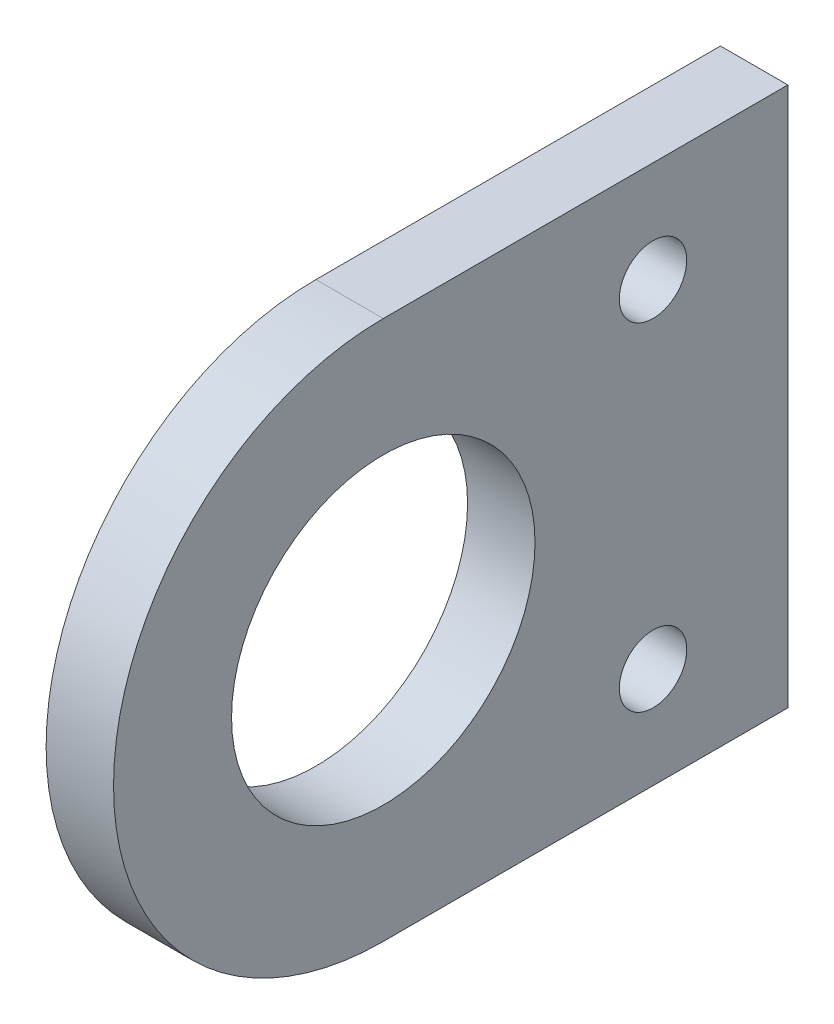
ISO-10303-21;
HEADER;
FILE_DESCRIPTION(('STEP AP214'),'2;1');
FILE_NAME('part.step','',(''),(''),'','','');
FILE_SCHEMA(('AUTOMOTIVE_DESIGN { 1 0 10303 214 1 1 1 1 }'));
ENDSEC;
DATA;
#1=APPLICATION_CONTEXT('core data for automotive mechanical design processes');
#2=APPLICATION_PROTOCOL_DEFINITION('international standard','automotive_design',2000,#1);
#3=PRODUCT_CONTEXT('',#1,'mechanical');
#4=PRODUCT('Part','Part','',(#3));
#5=PRODUCT_RELATED_PRODUCT_CATEGORY('part','',(#4));
#6=PRODUCT_DEFINITION_FORMATION('','',#4);
#7=PRODUCT_DEFINITION_CONTEXT('part definition',#1,'design');
#8=PRODUCT_DEFINITION('design','',#6,#7);
#9=PRODUCT_DEFINITION_SHAPE('','',#8);
#10=(LENGTH_UNIT() NAMED_UNIT(*) SI_UNIT(.MILLI.,.METRE.));
#11=(NAMED_UNIT(*) PLANE_ANGLE_UNIT() SI_UNIT($,.RADIAN.));
#12=(NAMED_UNIT(*) SI_UNIT($,.STERADIAN.) SOLID_ANGLE_UNIT());
#13=UNCERTAINTY_MEASURE_WITH_UNIT(LENGTH_MEASURE(1.E-05),#10,'distance_accuracy_value','');
#14=(GEOMETRIC_REPRESENTATION_CONTEXT(3) GLOBAL_UNCERTAINTY_ASSIGNED_CONTEXT((#13)) GLOBAL_UNIT_ASSIGNED_CONTEXT((#10,
#11,#12)) REPRESENTATION_CONTEXT('',''));
#15=CARTESIAN_POINT('',(0.,0.,0.));
#16=DIRECTION('',(0.,0.,1.));
#17=DIRECTION('',(1.,0.,0.));
#18=AXIS2_PLACEMENT_3D('',#15,#16,#17);
#19=CARTESIAN_POINT('',(6.35,0.,0.));
#20=DIRECTION('',(-1.,0.,0.));
#21=DIRECTION('',(0.,0.,1.));
#22=AXIS2_PLACEMENT_3D('',#19,#20,#21);
#23=PLANE('',#22);
#24=CARTESIAN_POINT('',(6.35,0.,0.));
#25=DIRECTION('',(1.,0.,0.));
#26=DIRECTION('',(0.,0.,1.));
#27=AXIS2_PLACEMENT_3D('',#24,#25,#26);
#28=CIRCLE('',#27,25.4);
#29=CARTESIAN_POINT('',(6.35,25.4,0.));
#30=VERTEX_POINT('',#29);
#31=CARTESIAN_POINT('',(6.35,-25.4,0.));
#32=VERTEX_POINT('',#31);
#33=EDGE_CURVE('E84',#30,#32,#28,.T.);
#34=ORIENTED_EDGE('',*,*,#33,.T.);
#35=DIRECTION('',(0.,0.,-1.));
#36=VECTOR('',#35,1.);
#37=CARTESIAN_POINT('',(6.35,-25.4,-38.1));
#38=LINE('',#37,#36);
#39=CARTESIAN_POINT('',(6.35,-25.4,-38.1));
#40=VERTEX_POINT('',#39);
#41=EDGE_CURVE('E79',#32,#40,#38,.T.);
#42=ORIENTED_EDGE('',*,*,#41,.T.);
#43=DIRECTION('',(0.,1.,0.));
#44=VECTOR('',#43,1.);
#45=CARTESIAN_POINT('',(6.35,25.4,-38.1));
#46=LINE('',#45,#44);
#47=CARTESIAN_POINT('',(6.35,25.4,-38.1));
#48=VERTEX_POINT('',#47);
#49=EDGE_CURVE('E82',#40,#48,#46,.T.);
#50=ORIENTED_EDGE('',*,*,#49,.T.);
#51=DIRECTION('',(0.,0.,1.));
#52=VECTOR('',#51,1.);
#53=CARTESIAN_POINT('',(6.35,25.4,0.));
#54=LINE('',#53,#52);
#55=EDGE_CURVE('E49',#48,#30,#54,.T.);
#56=ORIENTED_EDGE('',*,*,#55,.T.);
#57=EDGE_LOOP('',(#34,#42,#50,#56));
#58=FACE_BOUND('',#57,.T.);
#59=CARTESIAN_POINT('',(6.35,0.,0.));
#60=DIRECTION('',(1.,0.,0.));
#61=DIRECTION('',(0.,0.,-1.));
#62=AXIS2_PLACEMENT_3D('',#59,#60,#61);
#63=CIRCLE('',#62,14.2875);
#64=CARTESIAN_POINT('',(6.35,0.,-14.2875));
#65=VERTEX_POINT('',#64);
#66=EDGE_CURVE('E99',#65,#65,#63,.T.);
#67=ORIENTED_EDGE('',*,*,#66,.F.);
#68=EDGE_LOOP('',(#67));
#69=FACE_BOUND('',#68,.T.);
#70=CARTESIAN_POINT('',(6.35,15.875,-25.4));
#71=DIRECTION('',(1.,0.,0.));
#72=DIRECTION('',(0.,0.,-1.));
#73=AXIS2_PLACEMENT_3D('',#70,#71,#72);
#74=CIRCLE('',#73,3.175);
#75=CARTESIAN_POINT('',(6.35,15.875,-28.575));
#76=VERTEX_POINT('',#75);
#77=EDGE_CURVE('E114',#76,#76,#74,.T.);
#78=ORIENTED_EDGE('',*,*,#77,.F.);
#79=EDGE_LOOP('',(#78));
#80=FACE_BOUND('',#79,.T.);
#81=CARTESIAN_POINT('',(6.35,-15.875,-25.4));
#82=DIRECTION('',(1.,0.,0.));
#83=DIRECTION('',(0.,0.,-1.));
#84=AXIS2_PLACEMENT_3D('',#81,#82,#83);
#85=CIRCLE('',#84,3.175);
#86=CARTESIAN_POINT('',(6.35,-15.875,-28.575));
#87=VERTEX_POINT('',#86);
#88=EDGE_CURVE('E120',#87,#87,#85,.T.);
#89=ORIENTED_EDGE('',*,*,#88,.F.);
#90=EDGE_LOOP('',(#89));
#91=FACE_BOUND('',#90,.T.);
#92=ADVANCED_FACE('F32',(#58,#69,#80,#91),#23,.F.);
#93=CARTESIAN_POINT('',(0.,0.,0.));
#94=DIRECTION('',(-1.,0.,0.));
#95=DIRECTION('',(0.,0.,1.));
#96=AXIS2_PLACEMENT_3D('',#93,#94,#95);
#97=PLANE('',#96);
#98=CARTESIAN_POINT('',(0.,15.875,-25.4));
#99=DIRECTION('',(1.,0.,0.));
#100=DIRECTION('',(0.,0.,-1.));
#101=AXIS2_PLACEMENT_3D('',#98,#99,#100);
#102=CIRCLE('',#101,3.175);
#103=CARTESIAN_POINT('',(0.,15.875,-28.575));
#104=VERTEX_POINT('',#103);
#105=EDGE_CURVE('E117',#104,#104,#102,.T.);
#106=ORIENTED_EDGE('',*,*,#105,.T.);
#107=EDGE_LOOP('',(#106));
#108=FACE_BOUND('',#107,.T.);
#109=CARTESIAN_POINT('',(0.,0.,0.));
#110=DIRECTION('',(1.,0.,0.));
#111=DIRECTION('',(0.,0.,1.));
#112=AXIS2_PLACEMENT_3D('',#109,#110,#111);
#113=CIRCLE('',#112,25.4);
#114=CARTESIAN_POINT('',(0.,25.4,0.));
#115=VERTEX_POINT('',#114);
#116=CARTESIAN_POINT('',(0.,-25.4,0.));
#117=VERTEX_POINT('',#116);
#118=EDGE_CURVE('E96',#115,#117,#113,.T.);
#119=ORIENTED_EDGE('',*,*,#118,.F.);
#120=DIRECTION('',(0.,0.,1.));
#121=VECTOR('',#120,1.);
#122=CARTESIAN_POINT('',(0.,25.4,0.));
#123=LINE('',#122,#121);
#124=CARTESIAN_POINT('',(0.,25.4,-38.1));
#125=VERTEX_POINT('',#124);
#126=EDGE_CURVE('E72',#125,#115,#123,.T.);
#127=ORIENTED_EDGE('',*,*,#126,.F.);
#128=DIRECTION('',(0.,1.,0.));
#129=VECTOR('',#128,1.);
#130=CARTESIAN_POINT('',(0.,25.4,-38.1));
#131=LINE('',#130,#129);
#132=CARTESIAN_POINT('',(0.,-25.4,-38.1));
#133=VERTEX_POINT('',#132);
#134=EDGE_CURVE('E66',#133,#125,#131,.T.);
#135=ORIENTED_EDGE('',*,*,#134,.F.);
#136=DIRECTION('',(0.,0.,-1.));
#137=VECTOR('',#136,1.);
#138=CARTESIAN_POINT('',(0.,-25.4,-38.1));
#139=LINE('',#138,#137);
#140=EDGE_CURVE('E88',#117,#133,#139,.T.);
#141=ORIENTED_EDGE('',*,*,#140,.F.);
#142=EDGE_LOOP('',(#119,#127,#135,#141));
#143=FACE_BOUND('',#142,.T.);
#144=CARTESIAN_POINT('',(0.,0.,0.));
#145=DIRECTION('',(1.,0.,0.));
#146=DIRECTION('',(0.,0.,-1.));
#147=AXIS2_PLACEMENT_3D('',#144,#145,#146);
#148=CIRCLE('',#147,14.2875);
#149=CARTESIAN_POINT('',(0.,0.,-14.2875));
#150=VERTEX_POINT('',#149);
#151=EDGE_CURVE('E111',#150,#150,#148,.T.);
#152=ORIENTED_EDGE('',*,*,#151,.T.);
#153=EDGE_LOOP('',(#152));
#154=FACE_BOUND('',#153,.T.);
#155=CARTESIAN_POINT('',(0.,-15.875,-25.4));
#156=DIRECTION('',(1.,0.,0.));
#157=DIRECTION('',(0.,0.,-1.));
#158=AXIS2_PLACEMENT_3D('',#155,#156,#157);
#159=CIRCLE('',#158,3.175);
#160=CARTESIAN_POINT('',(0.,-15.875,-28.575));
#161=VERTEX_POINT('',#160);
#162=EDGE_CURVE('E123',#161,#161,#159,.T.);
#163=ORIENTED_EDGE('',*,*,#162,.T.);
#164=EDGE_LOOP('',(#163));
#165=FACE_BOUND('',#164,.T.);
#166=ADVANCED_FACE('F107',(#108,#143,#154,#165),#97,.T.);
#167=CARTESIAN_POINT('',(6.35,0.,0.));
#168=DIRECTION('',(-1.,0.,0.));
#169=DIRECTION('',(0.,0.,1.));
#170=AXIS2_PLACEMENT_3D('',#167,#168,#169);
#171=CYLINDRICAL_SURFACE('',#170,25.4);
#172=ORIENTED_EDGE('',*,*,#118,.T.);
#173=DIRECTION('',(-1.,0.,0.));
#174=VECTOR('',#173,1.);
#175=CARTESIAN_POINT('',(6.35,-25.4,0.));
#176=LINE('',#175,#174);
#177=EDGE_CURVE('E11',#32,#117,#176,.T.);
#178=ORIENTED_EDGE('',*,*,#177,.F.);
#179=ORIENTED_EDGE('',*,*,#33,.F.);
#180=DIRECTION('',(-1.,0.,0.));
#181=VECTOR('',#180,1.);
#182=CARTESIAN_POINT('',(6.35,25.4,0.));
#183=LINE('',#182,#181);
#184=EDGE_CURVE('E92',#30,#115,#183,.T.);
#185=ORIENTED_EDGE('',*,*,#184,.T.);
#186=EDGE_LOOP('',(#172,#178,#179,#185));
#187=FACE_BOUND('',#186,.T.);
#188=ADVANCED_FACE('F34',(#187),#171,.T.);
#189=CARTESIAN_POINT('',(6.35,-25.4,-38.1));
#190=DIRECTION('',(0.,1.,0.));
#191=DIRECTION('',(0.,0.,1.));
#192=AXIS2_PLACEMENT_3D('',#189,#190,#191);
#193=PLANE('',#192);
#194=ORIENTED_EDGE('',*,*,#140,.T.);
#195=DIRECTION('',(-1.,0.,0.));
#196=VECTOR('',#195,1.);
#197=CARTESIAN_POINT('',(6.35,-25.4,-38.1));
#198=LINE('',#197,#196);
#199=EDGE_CURVE('E41',#40,#133,#198,.T.);
#200=ORIENTED_EDGE('',*,*,#199,.F.);
#201=ORIENTED_EDGE('',*,*,#41,.F.);
#202=ORIENTED_EDGE('',*,*,#177,.T.);
#203=EDGE_LOOP('',(#194,#200,#201,#202));
#204=FACE_BOUND('',#203,.T.);
#205=ADVANCED_FACE('F87',(#204),#193,.F.);
#206=CARTESIAN_POINT('',(6.35,25.4,-38.1));
#207=DIRECTION('',(0.,0.,1.));
#208=DIRECTION('',(0.,-1.,0.));
#209=AXIS2_PLACEMENT_3D('',#206,#207,#208);
#210=PLANE('',#209);
#211=ORIENTED_EDGE('',*,*,#134,.T.);
#212=DIRECTION('',(-1.,0.,0.));
#213=VECTOR('',#212,1.);
#214=CARTESIAN_POINT('',(6.35,25.4,-38.1));
#215=LINE('',#214,#213);
#216=EDGE_CURVE('E89',#48,#125,#215,.T.);
#217=ORIENTED_EDGE('',*,*,#216,.F.);
#218=ORIENTED_EDGE('',*,*,#49,.F.);
#219=ORIENTED_EDGE('',*,*,#199,.T.);
#220=EDGE_LOOP('',(#211,#217,#218,#219));
#221=FACE_BOUND('',#220,.T.);
#222=ADVANCED_FACE('F90',(#221),#210,.F.);
#223=CARTESIAN_POINT('',(6.35,25.4,0.));
#224=DIRECTION('',(0.,-1.,0.));
#225=DIRECTION('',(0.,0.,-1.));
#226=AXIS2_PLACEMENT_3D('',#223,#224,#225);
#227=PLANE('',#226);
#228=ORIENTED_EDGE('',*,*,#126,.T.);
#229=ORIENTED_EDGE('',*,*,#184,.F.);
#230=ORIENTED_EDGE('',*,*,#55,.F.);
#231=ORIENTED_EDGE('',*,*,#216,.T.);
#232=EDGE_LOOP('',(#228,#229,#230,#231));
#233=FACE_BOUND('',#232,.T.);
#234=ADVANCED_FACE('F104',(#233),#227,.F.);
#235=CARTESIAN_POINT('',(6.35,0.,0.));
#236=DIRECTION('',(-1.,0.,0.));
#237=DIRECTION('',(0.,0.,1.));
#238=AXIS2_PLACEMENT_3D('',#235,#236,#237);
#239=CYLINDRICAL_SURFACE('',#238,14.2875);
#240=ORIENTED_EDGE('',*,*,#66,.T.);
#241=EDGE_LOOP('',(#240));
#242=FACE_BOUND('',#241,.T.);
#243=ORIENTED_EDGE('',*,*,#151,.F.);
#244=EDGE_LOOP('',(#243));
#245=FACE_BOUND('',#244,.T.);
#246=ADVANCED_FACE('F140',(#242,#245),#239,.F.);
#247=CARTESIAN_POINT('',(6.35,15.875,-25.4));
#248=DIRECTION('',(-1.,0.,0.));
#249=DIRECTION('',(0.,0.,1.));
#250=AXIS2_PLACEMENT_3D('',#247,#248,#249);
#251=CYLINDRICAL_SURFACE('',#250,3.175);
#252=ORIENTED_EDGE('',*,*,#77,.T.);
#253=EDGE_LOOP('',(#252));
#254=FACE_BOUND('',#253,.T.);
#255=ORIENTED_EDGE('',*,*,#105,.F.);
#256=EDGE_LOOP('',(#255));
#257=FACE_BOUND('',#256,.T.);
#258=ADVANCED_FACE('F186',(#254,#257),#251,.F.);
#259=CARTESIAN_POINT('',(6.35,-15.875,-25.4));
#260=DIRECTION('',(-1.,0.,0.));
#261=DIRECTION('',(0.,0.,1.));
#262=AXIS2_PLACEMENT_3D('',#259,#260,#261);
#263=CYLINDRICAL_SURFACE('',#262,3.175);
#264=ORIENTED_EDGE('',*,*,#88,.T.);
#265=EDGE_LOOP('',(#264));
#266=FACE_BOUND('',#265,.T.);
#267=ORIENTED_EDGE('',*,*,#162,.F.);
#268=EDGE_LOOP('',(#267));
#269=FACE_BOUND('',#268,.T.);
#270=ADVANCED_FACE('F129',(#266,#269),#263,.F.);
#271=CLOSED_SHELL('',(#92,#166,#188,#205,#222,#234,#246,#258,#270));
#272=MANIFOLD_SOLID_BREP('B2',#271);
#273=ADVANCED_BREP_SHAPE_REPRESENTATION('',(#18,#272),#14);
#274=SHAPE_DEFINITION_REPRESENTATION(#9,#273);
ENDSEC;
END-ISO-10303-21;
